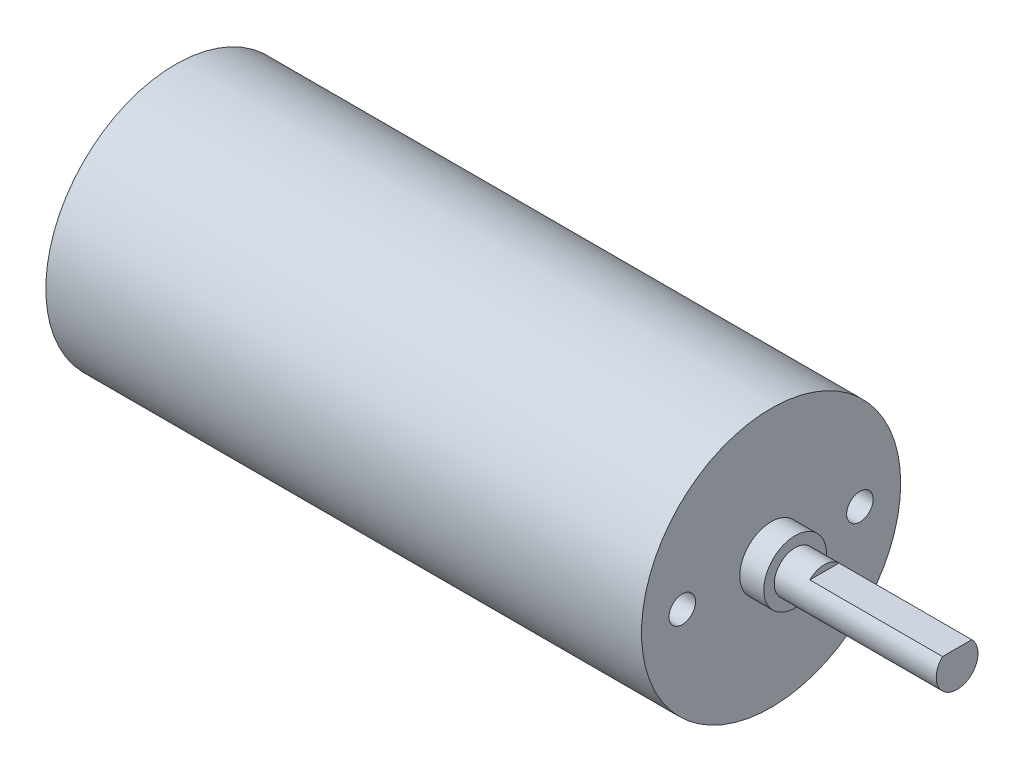
ISO-10303-21;
HEADER;
FILE_DESCRIPTION(('STEP AP214'),'2;1');
FILE_NAME('part.step','',(''),(''),'','','');
FILE_SCHEMA(('AUTOMOTIVE_DESIGN { 1 0 10303 214 1 1 1 1 }'));
ENDSEC;
DATA;
#1=APPLICATION_CONTEXT('core data for automotive mechanical design processes');
#2=APPLICATION_PROTOCOL_DEFINITION('international standard','automotive_design',2000,#1);
#3=PRODUCT_CONTEXT('',#1,'mechanical');
#4=PRODUCT('Part','Part','',(#3));
#5=PRODUCT_RELATED_PRODUCT_CATEGORY('part','',(#4));
#6=PRODUCT_DEFINITION_FORMATION('','',#4);
#7=PRODUCT_DEFINITION_CONTEXT('part definition',#1,'design');
#8=PRODUCT_DEFINITION('design','',#6,#7);
#9=PRODUCT_DEFINITION_SHAPE('','',#8);
#10=(LENGTH_UNIT() NAMED_UNIT(*) SI_UNIT(.MILLI.,.METRE.));
#11=(NAMED_UNIT(*) PLANE_ANGLE_UNIT() SI_UNIT($,.RADIAN.));
#12=(NAMED_UNIT(*) SI_UNIT($,.STERADIAN.) SOLID_ANGLE_UNIT());
#13=UNCERTAINTY_MEASURE_WITH_UNIT(LENGTH_MEASURE(1.E-05),#10,'distance_accuracy_value','');
#14=(GEOMETRIC_REPRESENTATION_CONTEXT(3) GLOBAL_UNCERTAINTY_ASSIGNED_CONTEXT((#13)) GLOBAL_UNIT_ASSIGNED_CONTEXT((#10,
#11,#12)) REPRESENTATION_CONTEXT('',''));
#15=CARTESIAN_POINT('',(0.,0.,0.));
#16=DIRECTION('',(0.,0.,1.));
#17=DIRECTION('',(1.,0.,0.));
#18=AXIS2_PLACEMENT_3D('',#15,#16,#17);
#19=CARTESIAN_POINT('',(-57.,0.,0.));
#20=DIRECTION('',(1.,0.,0.));
#21=DIRECTION('',(0.,0.,-1.));
#22=AXIS2_PLACEMENT_3D('',#19,#20,#21);
#23=CYLINDRICAL_SURFACE('',#22,12.4);
#24=CARTESIAN_POINT('',(-57.,0.,0.));
#25=DIRECTION('',(1.,0.,0.));
#26=DIRECTION('',(0.,0.,-1.));
#27=AXIS2_PLACEMENT_3D('',#24,#25,#26);
#28=CIRCLE('',#27,12.4);
#29=CARTESIAN_POINT('',(-57.,0.,-12.4));
#30=VERTEX_POINT('',#29);
#31=EDGE_CURVE('E89',#30,#30,#28,.T.);
#32=ORIENTED_EDGE('',*,*,#31,.T.);
#33=EDGE_LOOP('',(#32));
#34=FACE_BOUND('',#33,.T.);
#35=CARTESIAN_POINT('',(0.,0.,0.));
#36=DIRECTION('',(1.,0.,0.));
#37=DIRECTION('',(0.,0.,-1.));
#38=AXIS2_PLACEMENT_3D('',#35,#36,#37);
#39=CIRCLE('',#38,12.4);
#40=CARTESIAN_POINT('',(0.,0.,-12.4));
#41=VERTEX_POINT('',#40);
#42=EDGE_CURVE('E37',#41,#41,#39,.T.);
#43=ORIENTED_EDGE('',*,*,#42,.F.);
#44=EDGE_LOOP('',(#43));
#45=FACE_BOUND('',#44,.T.);
#46=ADVANCED_FACE('F34',(#34,#45),#23,.T.);
#47=CARTESIAN_POINT('',(-57.,0.,0.));
#48=DIRECTION('',(1.,0.,0.));
#49=DIRECTION('',(0.,0.,-1.));
#50=AXIS2_PLACEMENT_3D('',#47,#48,#49);
#51=PLANE('',#50);
#52=ORIENTED_EDGE('',*,*,#31,.F.);
#53=EDGE_LOOP('',(#52));
#54=FACE_BOUND('',#53,.T.);
#55=ADVANCED_FACE('F99',(#54),#51,.F.);
#56=CARTESIAN_POINT('',(0.,0.,0.));
#57=DIRECTION('',(1.,0.,0.));
#58=DIRECTION('',(0.,0.,-1.));
#59=AXIS2_PLACEMENT_3D('',#56,#57,#58);
#60=PLANE('',#59);
#61=CARTESIAN_POINT('',(0.,0.,-8.5));
#62=DIRECTION('',(1.,0.,0.));
#63=DIRECTION('',(0.,0.,-1.));
#64=AXIS2_PLACEMENT_3D('',#61,#62,#63);
#65=CIRCLE('',#64,1.27);
#66=CARTESIAN_POINT('',(0.,0.,-9.77));
#67=VERTEX_POINT('',#66);
#68=EDGE_CURVE('E82',#67,#67,#65,.T.);
#69=ORIENTED_EDGE('',*,*,#68,.F.);
#70=EDGE_LOOP('',(#69));
#71=FACE_BOUND('',#70,.T.);
#72=CARTESIAN_POINT('',(0.,0.,8.5));
#73=DIRECTION('',(1.,0.,0.));
#74=DIRECTION('',(0.,0.,-1.));
#75=AXIS2_PLACEMENT_3D('',#72,#73,#74);
#76=CIRCLE('',#75,1.27);
#77=CARTESIAN_POINT('',(0.,0.,7.23));
#78=VERTEX_POINT('',#77);
#79=EDGE_CURVE('E85',#78,#78,#76,.T.);
#80=ORIENTED_EDGE('',*,*,#79,.F.);
#81=EDGE_LOOP('',(#80));
#82=FACE_BOUND('',#81,.T.);
#83=CARTESIAN_POINT('',(0.,0.,0.));
#84=DIRECTION('',(1.,0.,0.));
#85=DIRECTION('',(0.,0.,-1.));
#86=AXIS2_PLACEMENT_3D('',#83,#84,#85);
#87=CIRCLE('',#86,3.);
#88=CARTESIAN_POINT('',(0.,0.,-3.));
#89=VERTEX_POINT('',#88);
#90=EDGE_CURVE('E42',#89,#89,#87,.T.);
#91=ORIENTED_EDGE('',*,*,#90,.F.);
#92=EDGE_LOOP('',(#91));
#93=FACE_BOUND('',#92,.T.);
#94=ORIENTED_EDGE('',*,*,#42,.T.);
#95=EDGE_LOOP('',(#94));
#96=FACE_BOUND('',#95,.T.);
#97=ADVANCED_FACE('F96',(#71,#82,#93,#96),#60,.T.);
#98=CARTESIAN_POINT('',(2.3,0.,0.));
#99=DIRECTION('',(-1.,0.,0.));
#100=DIRECTION('',(0.,0.,1.));
#101=AXIS2_PLACEMENT_3D('',#98,#99,#100);
#102=CYLINDRICAL_SURFACE('',#101,3.);
#103=CARTESIAN_POINT('',(2.3,0.,0.));
#104=DIRECTION('',(1.,0.,0.));
#105=DIRECTION('',(0.,0.,-1.));
#106=AXIS2_PLACEMENT_3D('',#103,#104,#105);
#107=CIRCLE('',#106,3.);
#108=CARTESIAN_POINT('',(2.3,0.,-3.));
#109=VERTEX_POINT('',#108);
#110=EDGE_CURVE('E76',#109,#109,#107,.T.);
#111=ORIENTED_EDGE('',*,*,#110,.F.);
#112=EDGE_LOOP('',(#111));
#113=FACE_BOUND('',#112,.T.);
#114=ORIENTED_EDGE('',*,*,#90,.T.);
#115=EDGE_LOOP('',(#114));
#116=FACE_BOUND('',#115,.T.);
#117=ADVANCED_FACE('F108',(#113,#116),#102,.T.);
#118=CARTESIAN_POINT('',(2.3,0.,0.));
#119=DIRECTION('',(1.,0.,0.));
#120=DIRECTION('',(0.,0.,-1.));
#121=AXIS2_PLACEMENT_3D('',#118,#119,#120);
#122=PLANE('',#121);
#123=CARTESIAN_POINT('',(2.3,0.,0.));
#124=DIRECTION('',(1.,0.,0.));
#125=DIRECTION('',(0.,0.,-1.));
#126=AXIS2_PLACEMENT_3D('',#123,#124,#125);
#127=CIRCLE('',#126,2.);
#128=CARTESIAN_POINT('',(2.3,0.,-2.));
#129=VERTEX_POINT('',#128);
#130=EDGE_CURVE('E11',#129,#129,#127,.T.);
#131=ORIENTED_EDGE('',*,*,#130,.F.);
#132=EDGE_LOOP('',(#131));
#133=FACE_BOUND('',#132,.T.);
#134=ORIENTED_EDGE('',*,*,#110,.T.);
#135=EDGE_LOOP('',(#134));
#136=FACE_BOUND('',#135,.T.);
#137=ADVANCED_FACE('F113',(#133,#136),#122,.T.);
#138=CARTESIAN_POINT('',(17.8,0.,0.));
#139=DIRECTION('',(-1.,0.,0.));
#140=DIRECTION('',(0.,0.,1.));
#141=AXIS2_PLACEMENT_3D('',#138,#139,#140);
#142=CYLINDRICAL_SURFACE('',#141,2.);
#143=CARTESIAN_POINT('',(17.8,0.,0.));
#144=DIRECTION('',(1.,0.,0.));
#145=DIRECTION('',(0.,0.,-1.));
#146=AXIS2_PLACEMENT_3D('',#143,#144,#145);
#147=CIRCLE('',#146,2.);
#148=CARTESIAN_POINT('',(17.8,1.429,1.39927088156654));
#149=VERTEX_POINT('',#148);
#150=CARTESIAN_POINT('',(17.8,1.429,-1.39927088156654));
#151=VERTEX_POINT('',#150);
#152=EDGE_CURVE('E72',#149,#151,#147,.T.);
#153=ORIENTED_EDGE('',*,*,#152,.F.);
#154=DIRECTION('',(1.,0.,0.));
#155=VECTOR('',#154,1.);
#156=CARTESIAN_POINT('',(5.1,1.429,1.39927088156654));
#157=LINE('',#156,#155);
#158=CARTESIAN_POINT('',(5.1,1.429,1.39927088156654));
#159=VERTEX_POINT('',#158);
#160=EDGE_CURVE('E50',#159,#149,#157,.T.);
#161=ORIENTED_EDGE('',*,*,#160,.F.);
#162=CARTESIAN_POINT('',(5.1,0.,0.));
#163=DIRECTION('',(1.,0.,0.));
#164=DIRECTION('',(0.,0.,1.));
#165=AXIS2_PLACEMENT_3D('',#162,#163,#164);
#166=CIRCLE('',#165,2.);
#167=CARTESIAN_POINT('',(5.1,1.429,-1.39927088156654));
#168=VERTEX_POINT('',#167);
#169=EDGE_CURVE('E73',#168,#159,#166,.T.);
#170=ORIENTED_EDGE('',*,*,#169,.F.);
#171=DIRECTION('',(1.,0.,0.));
#172=VECTOR('',#171,1.);
#173=CARTESIAN_POINT('',(5.1,1.429,-1.39927088156654));
#174=LINE('',#173,#172);
#175=EDGE_CURVE('E63',#168,#151,#174,.T.);
#176=ORIENTED_EDGE('',*,*,#175,.T.);
#177=EDGE_LOOP('',(#153,#161,#170,#176));
#178=FACE_BOUND('',#177,.T.);
#179=ORIENTED_EDGE('',*,*,#130,.T.);
#180=EDGE_LOOP('',(#179));
#181=FACE_BOUND('',#180,.T.);
#182=ADVANCED_FACE('F70',(#178,#181),#142,.T.);
#183=CARTESIAN_POINT('',(17.8,0.,0.));
#184=DIRECTION('',(1.,0.,0.));
#185=DIRECTION('',(0.,0.,-1.));
#186=AXIS2_PLACEMENT_3D('',#183,#184,#185);
#187=PLANE('',#186);
#188=DIRECTION('',(0.,0.,-1.));
#189=VECTOR('',#188,1.);
#190=CARTESIAN_POINT('',(17.8,1.429,0.));
#191=LINE('',#190,#189);
#192=EDGE_CURVE('E60',#149,#151,#191,.T.);
#193=ORIENTED_EDGE('',*,*,#192,.F.);
#194=ORIENTED_EDGE('',*,*,#152,.T.);
#195=EDGE_LOOP('',(#193,#194));
#196=FACE_BOUND('',#195,.T.);
#197=ADVANCED_FACE('F75',(#196),#187,.T.);
#198=CARTESIAN_POINT('',(-5.,0.,8.5));
#199=DIRECTION('',(1.,0.,0.));
#200=DIRECTION('',(0.,0.,-1.));
#201=AXIS2_PLACEMENT_3D('',#198,#199,#200);
#202=CYLINDRICAL_SURFACE('',#201,1.27);
#203=CARTESIAN_POINT('',(-5.,0.,8.5));
#204=DIRECTION('',(1.,0.,0.));
#205=DIRECTION('',(0.,0.,-1.));
#206=AXIS2_PLACEMENT_3D('',#203,#204,#205);
#207=CIRCLE('',#206,1.27);
#208=CARTESIAN_POINT('',(-5.,0.,7.23));
#209=VERTEX_POINT('',#208);
#210=EDGE_CURVE('E150',#209,#209,#207,.T.);
#211=ORIENTED_EDGE('',*,*,#210,.F.);
#212=EDGE_LOOP('',(#211));
#213=FACE_BOUND('',#212,.T.);
#214=ORIENTED_EDGE('',*,*,#79,.T.);
#215=EDGE_LOOP('',(#214));
#216=FACE_BOUND('',#215,.T.);
#217=ADVANCED_FACE('F122',(#213,#216),#202,.F.);
#218=CARTESIAN_POINT('',(-5.,0.,8.5));
#219=DIRECTION('',(1.,0.,0.));
#220=DIRECTION('',(0.,0.,-1.));
#221=AXIS2_PLACEMENT_3D('',#218,#219,#220);
#222=PLANE('',#221);
#223=ORIENTED_EDGE('',*,*,#210,.T.);
#224=EDGE_LOOP('',(#223));
#225=FACE_BOUND('',#224,.T.);
#226=ADVANCED_FACE('F125',(#225),#222,.T.);
#227=CARTESIAN_POINT('',(-5.,0.,-8.5));
#228=DIRECTION('',(1.,0.,0.));
#229=DIRECTION('',(0.,0.,-1.));
#230=AXIS2_PLACEMENT_3D('',#227,#228,#229);
#231=CYLINDRICAL_SURFACE('',#230,1.27);
#232=CARTESIAN_POINT('',(-5.,0.,-8.5));
#233=DIRECTION('',(1.,0.,0.));
#234=DIRECTION('',(0.,0.,-1.));
#235=AXIS2_PLACEMENT_3D('',#232,#233,#234);
#236=CIRCLE('',#235,1.27);
#237=CARTESIAN_POINT('',(-5.,0.,-9.77));
#238=VERTEX_POINT('',#237);
#239=EDGE_CURVE('E77',#238,#238,#236,.T.);
#240=ORIENTED_EDGE('',*,*,#239,.F.);
#241=EDGE_LOOP('',(#240));
#242=FACE_BOUND('',#241,.T.);
#243=ORIENTED_EDGE('',*,*,#68,.T.);
#244=EDGE_LOOP('',(#243));
#245=FACE_BOUND('',#244,.T.);
#246=ADVANCED_FACE('F129',(#242,#245),#231,.F.);
#247=CARTESIAN_POINT('',(-5.,0.,-8.5));
#248=DIRECTION('',(1.,0.,0.));
#249=DIRECTION('',(0.,0.,-1.));
#250=AXIS2_PLACEMENT_3D('',#247,#248,#249);
#251=PLANE('',#250);
#252=ORIENTED_EDGE('',*,*,#239,.T.);
#253=EDGE_LOOP('',(#252));
#254=FACE_BOUND('',#253,.T.);
#255=ADVANCED_FACE('F133',(#254),#251,.T.);
#256=CARTESIAN_POINT('',(5.1,1.429,0.));
#257=DIRECTION('',(0.,-1.,0.));
#258=DIRECTION('',(0.,0.,-1.));
#259=AXIS2_PLACEMENT_3D('',#256,#257,#258);
#260=PLANE('',#259);
#261=ORIENTED_EDGE('',*,*,#192,.T.);
#262=ORIENTED_EDGE('',*,*,#175,.F.);
#263=DIRECTION('',(0.,0.,-1.));
#264=VECTOR('',#263,1.);
#265=CARTESIAN_POINT('',(5.1,1.429,0.));
#266=LINE('',#265,#264);
#267=EDGE_CURVE('E56',#159,#168,#266,.T.);
#268=ORIENTED_EDGE('',*,*,#267,.F.);
#269=ORIENTED_EDGE('',*,*,#160,.T.);
#270=EDGE_LOOP('',(#261,#262,#268,#269));
#271=FACE_BOUND('',#270,.T.);
#272=ADVANCED_FACE('F62',(#271),#260,.F.);
#273=CARTESIAN_POINT('',(5.1,0.,0.));
#274=DIRECTION('',(-1.,0.,0.));
#275=DIRECTION('',(0.,0.,1.));
#276=AXIS2_PLACEMENT_3D('',#273,#274,#275);
#277=PLANE('',#276);
#278=ORIENTED_EDGE('',*,*,#267,.T.);
#279=ORIENTED_EDGE('',*,*,#169,.T.);
#280=EDGE_LOOP('',(#278,#279));
#281=FACE_BOUND('',#280,.T.);
#282=ADVANCED_FACE('F140',(#281),#277,.F.);
#283=CLOSED_SHELL('',(#46,#55,#97,#117,#137,#182,#197,#217,#226,#246,#255,#272,#282));
#284=MANIFOLD_SOLID_BREP('B2',#283);
#285=ADVANCED_BREP_SHAPE_REPRESENTATION('',(#18,#284),#14);
#286=SHAPE_DEFINITION_REPRESENTATION(#9,#285);
ENDSEC;
END-ISO-10303-21;
